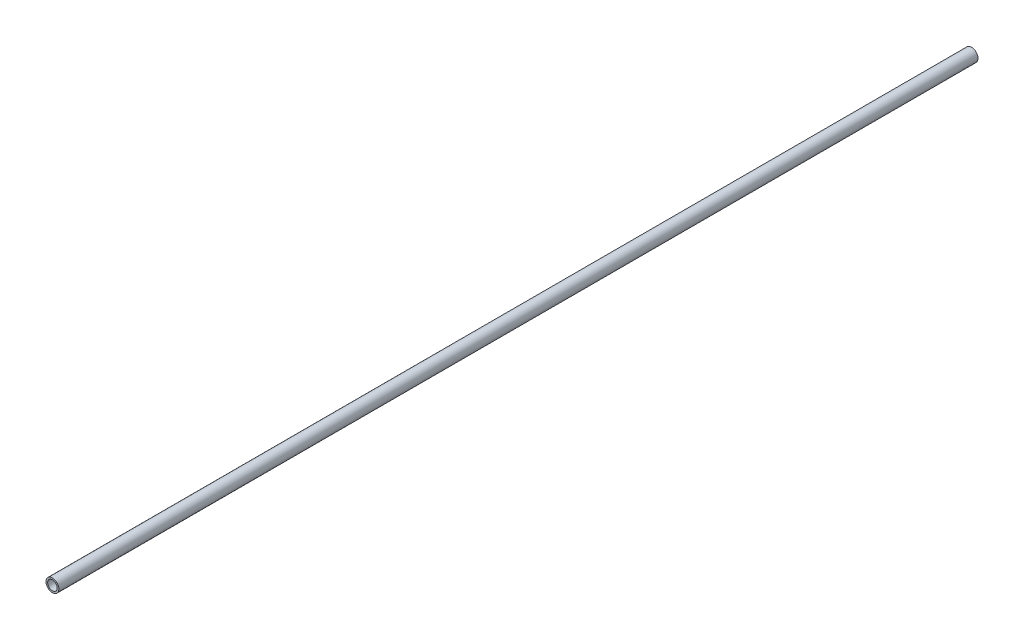
ISO-10303-21;
HEADER;
FILE_DESCRIPTION(('STEP AP214'),'2;1');
FILE_NAME('part.step','',(''),(''),'','','');
FILE_SCHEMA(('AUTOMOTIVE_DESIGN { 1 0 10303 214 1 1 1 1 }'));
ENDSEC;
DATA;
#1=APPLICATION_CONTEXT('core data for automotive mechanical design processes');
#2=APPLICATION_PROTOCOL_DEFINITION('international standard','automotive_design',2000,#1);
#3=PRODUCT_CONTEXT('',#1,'mechanical');
#4=PRODUCT('Part','Part','',(#3));
#5=PRODUCT_RELATED_PRODUCT_CATEGORY('part','',(#4));
#6=PRODUCT_DEFINITION_FORMATION('','',#4);
#7=PRODUCT_DEFINITION_CONTEXT('part definition',#1,'design');
#8=PRODUCT_DEFINITION('design','',#6,#7);
#9=PRODUCT_DEFINITION_SHAPE('','',#8);
#10=(LENGTH_UNIT() NAMED_UNIT(*) SI_UNIT(.MILLI.,.METRE.));
#11=(NAMED_UNIT(*) PLANE_ANGLE_UNIT() SI_UNIT($,.RADIAN.));
#12=(NAMED_UNIT(*) SI_UNIT($,.STERADIAN.) SOLID_ANGLE_UNIT());
#13=UNCERTAINTY_MEASURE_WITH_UNIT(LENGTH_MEASURE(1.E-05),#10,'distance_accuracy_value','');
#14=(GEOMETRIC_REPRESENTATION_CONTEXT(3) GLOBAL_UNCERTAINTY_ASSIGNED_CONTEXT((#13)) GLOBAL_UNIT_ASSIGNED_CONTEXT((#10,
#11,#12)) REPRESENTATION_CONTEXT('',''));
#15=CARTESIAN_POINT('',(0.,0.,0.));
#16=DIRECTION('',(0.,0.,1.));
#17=DIRECTION('',(1.,0.,0.));
#18=AXIS2_PLACEMENT_3D('',#15,#16,#17);
#19=CARTESIAN_POINT('',(0.,0.,1524.));
#20=DIRECTION('',(0.,0.,1.));
#21=DIRECTION('',(1.,0.,0.));
#22=AXIS2_PLACEMENT_3D('',#19,#20,#21);
#23=PLANE('',#22);
#24=CARTESIAN_POINT('',(0.,0.,1524.));
#25=DIRECTION('',(0.,0.,1.));
#26=DIRECTION('',(1.,0.,0.));
#27=AXIS2_PLACEMENT_3D('',#24,#25,#26);
#28=CIRCLE('',#27,10.668);
#29=CARTESIAN_POINT('',(10.668,0.,1524.));
#30=VERTEX_POINT('',#29);
#31=EDGE_CURVE('E10',#30,#30,#28,.T.);
#32=ORIENTED_EDGE('',*,*,#31,.T.);
#33=EDGE_LOOP('',(#32));
#34=FACE_BOUND('',#33,.T.);
#35=CARTESIAN_POINT('',(0.,0.,1524.));
#36=DIRECTION('',(0.,0.,1.));
#37=DIRECTION('',(1.,0.,0.));
#38=AXIS2_PLACEMENT_3D('',#35,#36,#37);
#39=CIRCLE('',#38,7.8994);
#40=CARTESIAN_POINT('',(7.8994,0.,1524.));
#41=VERTEX_POINT('',#40);
#42=EDGE_CURVE('E50',#41,#41,#39,.T.);
#43=ORIENTED_EDGE('',*,*,#42,.F.);
#44=EDGE_LOOP('',(#43));
#45=FACE_BOUND('',#44,.T.);
#46=ADVANCED_FACE('F37',(#34,#45),#23,.T.);
#47=CARTESIAN_POINT('',(0.,0.,0.));
#48=DIRECTION('',(0.,0.,1.));
#49=DIRECTION('',(1.,0.,0.));
#50=AXIS2_PLACEMENT_3D('',#47,#48,#49);
#51=PLANE('',#50);
#52=CARTESIAN_POINT('',(0.,0.,0.));
#53=DIRECTION('',(0.,0.,1.));
#54=DIRECTION('',(1.,0.,0.));
#55=AXIS2_PLACEMENT_3D('',#52,#53,#54);
#56=CIRCLE('',#55,10.668);
#57=CARTESIAN_POINT('',(10.668,0.,0.));
#58=VERTEX_POINT('',#57);
#59=EDGE_CURVE('E41',#58,#58,#56,.T.);
#60=ORIENTED_EDGE('',*,*,#59,.F.);
#61=EDGE_LOOP('',(#60));
#62=FACE_BOUND('',#61,.T.);
#63=CARTESIAN_POINT('',(0.,0.,0.));
#64=DIRECTION('',(0.,0.,1.));
#65=DIRECTION('',(1.,0.,0.));
#66=AXIS2_PLACEMENT_3D('',#63,#64,#65);
#67=CIRCLE('',#66,7.8994);
#68=CARTESIAN_POINT('',(7.8994,0.,0.));
#69=VERTEX_POINT('',#68);
#70=EDGE_CURVE('E52',#69,#69,#67,.T.);
#71=ORIENTED_EDGE('',*,*,#70,.T.);
#72=EDGE_LOOP('',(#71));
#73=FACE_BOUND('',#72,.T.);
#74=ADVANCED_FACE('F64',(#62,#73),#51,.F.);
#75=CARTESIAN_POINT('',(0.,0.,1524.));
#76=DIRECTION('',(0.,0.,-1.));
#77=DIRECTION('',(-1.,0.,0.));
#78=AXIS2_PLACEMENT_3D('',#75,#76,#77);
#79=CYLINDRICAL_SURFACE('',#78,10.668);
#80=ORIENTED_EDGE('',*,*,#31,.F.);
#81=EDGE_LOOP('',(#80));
#82=FACE_BOUND('',#81,.T.);
#83=ORIENTED_EDGE('',*,*,#59,.T.);
#84=EDGE_LOOP('',(#83));
#85=FACE_BOUND('',#84,.T.);
#86=ADVANCED_FACE('F39',(#82,#85),#79,.T.);
#87=CARTESIAN_POINT('',(0.,0.,1524.));
#88=DIRECTION('',(0.,0.,-1.));
#89=DIRECTION('',(-1.,0.,0.));
#90=AXIS2_PLACEMENT_3D('',#87,#88,#89);
#91=CYLINDRICAL_SURFACE('',#90,7.8994);
#92=ORIENTED_EDGE('',*,*,#42,.T.);
#93=EDGE_LOOP('',(#92));
#94=FACE_BOUND('',#93,.T.);
#95=ORIENTED_EDGE('',*,*,#70,.F.);
#96=EDGE_LOOP('',(#95));
#97=FACE_BOUND('',#96,.T.);
#98=ADVANCED_FACE('F60',(#94,#97),#91,.F.);
#99=CLOSED_SHELL('',(#46,#74,#86,#98));
#100=MANIFOLD_SOLID_BREP('B2',#99);
#101=ADVANCED_BREP_SHAPE_REPRESENTATION('',(#18,#100),#14);
#102=SHAPE_DEFINITION_REPRESENTATION(#9,#101);
ENDSEC;
END-ISO-10303-21;
